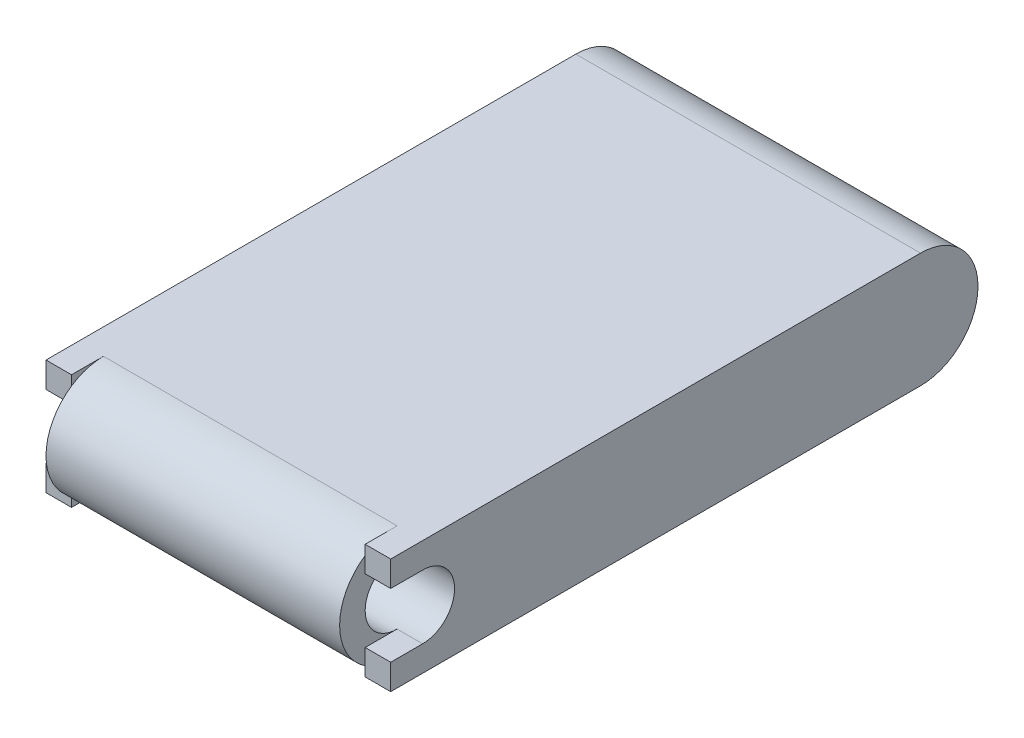
ISO-10303-21;
HEADER;
FILE_DESCRIPTION(('STEP AP214'),'2;1');
FILE_NAME('part.step','',(''),(''),'','','');
FILE_SCHEMA(('AUTOMOTIVE_DESIGN { 1 0 10303 214 1 1 1 1 }'));
ENDSEC;
DATA;
#1=APPLICATION_CONTEXT('core data for automotive mechanical design processes');
#2=APPLICATION_PROTOCOL_DEFINITION('international standard','automotive_design',2000,#1);
#3=PRODUCT_CONTEXT('',#1,'mechanical');
#4=PRODUCT('Part','Part','',(#3));
#5=PRODUCT_RELATED_PRODUCT_CATEGORY('part','',(#4));
#6=PRODUCT_DEFINITION_FORMATION('','',#4);
#7=PRODUCT_DEFINITION_CONTEXT('part definition',#1,'design');
#8=PRODUCT_DEFINITION('design','',#6,#7);
#9=PRODUCT_DEFINITION_SHAPE('','',#8);
#10=(LENGTH_UNIT() NAMED_UNIT(*) SI_UNIT(.MILLI.,.METRE.));
#11=(NAMED_UNIT(*) PLANE_ANGLE_UNIT() SI_UNIT($,.RADIAN.));
#12=(NAMED_UNIT(*) SI_UNIT($,.STERADIAN.) SOLID_ANGLE_UNIT());
#13=UNCERTAINTY_MEASURE_WITH_UNIT(LENGTH_MEASURE(1.E-05),#10,'distance_accuracy_value','');
#14=(GEOMETRIC_REPRESENTATION_CONTEXT(3) GLOBAL_UNCERTAINTY_ASSIGNED_CONTEXT((#13)) GLOBAL_UNIT_ASSIGNED_CONTEXT((#10,
#11,#12)) REPRESENTATION_CONTEXT('',''));
#15=CARTESIAN_POINT('',(0.,0.,0.));
#16=DIRECTION('',(0.,0.,1.));
#17=DIRECTION('',(1.,0.,0.));
#18=AXIS2_PLACEMENT_3D('',#15,#16,#17);
#19=CARTESIAN_POINT('',(-9.27481,0.,15.72768));
#20=DIRECTION('',(-1.,0.,0.));
#21=DIRECTION('',(0.,0.,-1.));
#22=AXIS2_PLACEMENT_3D('',#19,#20,#21);
#23=PLANE('',#22);
#24=CARTESIAN_POINT('',(-9.27481,0.,15.72768));
#25=DIRECTION('',(-1.,0.,0.));
#26=DIRECTION('',(0.,0.,1.));
#27=AXIS2_PLACEMENT_3D('',#24,#25,#26);
#28=CIRCLE('',#27,2.01676);
#29=CARTESIAN_POINT('',(-9.27481,2.01676,15.72768));
#30=VERTEX_POINT('',#29);
#31=CARTESIAN_POINT('',(-9.27481,-2.01676,15.72768));
#32=VERTEX_POINT('',#31);
#33=EDGE_CURVE('E269',#30,#32,#28,.F.);
#34=ORIENTED_EDGE('',*,*,#33,.T.);
#35=DIRECTION('',(0.,0.,1.));
#36=VECTOR('',#35,1.);
#37=CARTESIAN_POINT('',(-9.27481,-2.01676,15.72768));
#38=LINE('',#37,#36);
#39=CARTESIAN_POINT('',(-9.27481,-2.01676,17.74444));
#40=VERTEX_POINT('',#39);
#41=EDGE_CURVE('E49',#32,#40,#38,.T.);
#42=ORIENTED_EDGE('',*,*,#41,.T.);
#43=DIRECTION('',(0.,-1.,0.));
#44=VECTOR('',#43,1.);
#45=CARTESIAN_POINT('',(-9.27481,-2.01676,17.74444));
#46=LINE('',#45,#44);
#47=CARTESIAN_POINT('',(-9.27481,-3.01779900225313,17.74444));
#48=VERTEX_POINT('',#47);
#49=EDGE_CURVE('E186',#40,#48,#46,.T.);
#50=ORIENTED_EDGE('',*,*,#49,.T.);
#51=CARTESIAN_POINT('',(-9.27481,0.,15.72768));
#52=DIRECTION('',(1.,0.,0.));
#53=DIRECTION('',(0.,0.,-1.));
#54=AXIS2_PLACEMENT_3D('',#51,#52,#53);
#55=CIRCLE('',#54,3.62966);
#56=CARTESIAN_POINT('',(-9.27481,3.01779900225313,17.74444));
#57=VERTEX_POINT('',#56);
#58=EDGE_CURVE('E267',#57,#48,#55,.T.);
#59=ORIENTED_EDGE('',*,*,#58,.F.);
#60=DIRECTION('',(0.,-1.,0.));
#61=VECTOR('',#60,1.);
#62=CARTESIAN_POINT('',(-9.27481,3.62966,17.74444));
#63=LINE('',#62,#61);
#64=CARTESIAN_POINT('',(-9.27481,2.01676,17.74444));
#65=VERTEX_POINT('',#64);
#66=EDGE_CURVE('E56',#57,#65,#63,.T.);
#67=ORIENTED_EDGE('',*,*,#66,.T.);
#68=DIRECTION('',(0.,0.,-1.));
#69=VECTOR('',#68,1.);
#70=CARTESIAN_POINT('',(-9.27481,2.01676,15.72768));
#71=LINE('',#70,#69);
#72=EDGE_CURVE('E180',#65,#30,#71,.T.);
#73=ORIENTED_EDGE('',*,*,#72,.T.);
#74=EDGE_LOOP('',(#34,#42,#50,#59,#67,#73));
#75=FACE_BOUND('',#74,.T.);
#76=ADVANCED_FACE('F32',(#75),#23,.T.);
#77=CARTESIAN_POINT('',(-10.88771,0.,15.72768));
#78=DIRECTION('',(1.,0.,0.));
#79=DIRECTION('',(0.,0.,-1.));
#80=AXIS2_PLACEMENT_3D('',#77,#78,#79);
#81=CYLINDRICAL_SURFACE('',#80,3.62966);
#82=DIRECTION('',(1.,0.,0.));
#83=VECTOR('',#82,1.);
#84=CARTESIAN_POINT('',(-10.88771,3.62966,15.72768));
#85=LINE('',#84,#83);
#86=CARTESIAN_POINT('',(-9.27481,3.62966,15.72768));
#87=VERTEX_POINT('',#86);
#88=CARTESIAN_POINT('',(9.27481,3.62966,15.72768));
#89=VERTEX_POINT('',#88);
#90=EDGE_CURVE('E11',#87,#89,#85,.T.);
#91=ORIENTED_EDGE('',*,*,#90,.F.);
#92=EDGE_CURVE('E164',#87,#57,#55,.T.);
#93=ORIENTED_EDGE('',*,*,#92,.T.);
#94=ORIENTED_EDGE('',*,*,#58,.T.);
#95=CARTESIAN_POINT('',(-9.27481,0.,15.72768));
#96=DIRECTION('',(-1.,0.,0.));
#97=DIRECTION('',(0.,0.,1.));
#98=AXIS2_PLACEMENT_3D('',#95,#96,#97);
#99=CIRCLE('',#98,3.62966);
#100=CARTESIAN_POINT('',(-9.27481,-3.62966,15.72768));
#101=VERTEX_POINT('',#100);
#102=EDGE_CURVE('E205',#48,#101,#99,.F.);
#103=ORIENTED_EDGE('',*,*,#102,.T.);
#104=DIRECTION('',(1.,0.,0.));
#105=VECTOR('',#104,1.);
#106=CARTESIAN_POINT('',(-10.88771,-3.62966,15.72768));
#107=LINE('',#106,#105);
#108=CARTESIAN_POINT('',(9.27481,-3.62966,15.72768));
#109=VERTEX_POINT('',#108);
#110=EDGE_CURVE('E289',#101,#109,#107,.T.);
#111=ORIENTED_EDGE('',*,*,#110,.T.);
#112=CARTESIAN_POINT('',(9.27481,0.,15.72768));
#113=DIRECTION('',(1.,0.,0.));
#114=DIRECTION('',(0.,0.,-1.));
#115=AXIS2_PLACEMENT_3D('',#112,#113,#114);
#116=CIRCLE('',#115,3.62966);
#117=CARTESIAN_POINT('',(9.27481,-3.01779900225313,17.74444));
#118=VERTEX_POINT('',#117);
#119=EDGE_CURVE('E254',#109,#118,#116,.F.);
#120=ORIENTED_EDGE('',*,*,#119,.T.);
#121=CARTESIAN_POINT('',(9.27481,0.,15.72768));
#122=DIRECTION('',(1.,0.,0.));
#123=DIRECTION('',(0.,0.,-1.));
#124=AXIS2_PLACEMENT_3D('',#121,#122,#123);
#125=CIRCLE('',#124,3.62966);
#126=CARTESIAN_POINT('',(9.27481,3.01779900225313,17.74444));
#127=VERTEX_POINT('',#126);
#128=EDGE_CURVE('E271',#127,#118,#125,.T.);
#129=ORIENTED_EDGE('',*,*,#128,.F.);
#130=EDGE_CURVE('E272',#89,#127,#125,.T.);
#131=ORIENTED_EDGE('',*,*,#130,.F.);
#132=EDGE_LOOP('',(#91,#93,#94,#103,#111,#120,#129,#131));
#133=FACE_BOUND('',#132,.T.);
#134=ADVANCED_FACE('F34',(#133),#81,.T.);
#135=CARTESIAN_POINT('',(-10.88771,0.,15.72768));
#136=DIRECTION('',(1.,0.,0.));
#137=DIRECTION('',(0.,0.,-1.));
#138=AXIS2_PLACEMENT_3D('',#135,#136,#137);
#139=CYLINDRICAL_SURFACE('',#138,2.01676);
#140=CARTESIAN_POINT('',(9.27481,0.,15.72768));
#141=DIRECTION('',(1.,0.,0.));
#142=DIRECTION('',(0.,0.,-1.));
#143=AXIS2_PLACEMENT_3D('',#140,#141,#142);
#144=CIRCLE('',#143,2.01676);
#145=CARTESIAN_POINT('',(9.27481,-2.01676,15.72768));
#146=VERTEX_POINT('',#145);
#147=CARTESIAN_POINT('',(9.27481,2.01676,15.72768));
#148=VERTEX_POINT('',#147);
#149=EDGE_CURVE('E36',#146,#148,#144,.F.);
#150=ORIENTED_EDGE('',*,*,#149,.F.);
#151=DIRECTION('',(1.,0.,0.));
#152=VECTOR('',#151,1.);
#153=CARTESIAN_POINT('',(9.27481,-2.01676,15.72768));
#154=LINE('',#153,#152);
#155=CARTESIAN_POINT('',(10.88771,-2.01676,15.72768));
#156=VERTEX_POINT('',#155);
#157=EDGE_CURVE('E238',#146,#156,#154,.T.);
#158=ORIENTED_EDGE('',*,*,#157,.T.);
#159=CARTESIAN_POINT('',(10.88771,0.,15.72768));
#160=DIRECTION('',(-1.,0.,0.));
#161=DIRECTION('',(0.,0.,-1.));
#162=AXIS2_PLACEMENT_3D('',#159,#160,#161);
#163=CIRCLE('',#162,2.01676);
#164=CARTESIAN_POINT('',(10.88771,2.01676,15.72768));
#165=VERTEX_POINT('',#164);
#166=EDGE_CURVE('E216',#165,#156,#163,.T.);
#167=ORIENTED_EDGE('',*,*,#166,.F.);
#168=DIRECTION('',(1.,0.,0.));
#169=VECTOR('',#168,1.);
#170=CARTESIAN_POINT('',(9.27481,2.01676,15.72768));
#171=LINE('',#170,#169);
#172=EDGE_CURVE('E252',#148,#165,#171,.T.);
#173=ORIENTED_EDGE('',*,*,#172,.F.);
#174=EDGE_LOOP('',(#150,#158,#167,#173));
#175=FACE_BOUND('',#174,.T.);
#176=ORIENTED_EDGE('',*,*,#33,.F.);
#177=DIRECTION('',(-1.,0.,0.));
#178=VECTOR('',#177,1.);
#179=CARTESIAN_POINT('',(-9.27481,2.01676,15.72768));
#180=LINE('',#179,#178);
#181=CARTESIAN_POINT('',(-10.88771,2.01676,15.72768));
#182=VERTEX_POINT('',#181);
#183=EDGE_CURVE('E189',#30,#182,#180,.T.);
#184=ORIENTED_EDGE('',*,*,#183,.T.);
#185=CARTESIAN_POINT('',(-10.88771,0.,15.72768));
#186=DIRECTION('',(-1.,0.,0.));
#187=DIRECTION('',(0.,0.,-1.));
#188=AXIS2_PLACEMENT_3D('',#185,#186,#187);
#189=CIRCLE('',#188,2.01676);
#190=CARTESIAN_POINT('',(-10.88771,-2.01676,15.72768));
#191=VERTEX_POINT('',#190);
#192=EDGE_CURVE('E190',#182,#191,#189,.T.);
#193=ORIENTED_EDGE('',*,*,#192,.T.);
#194=DIRECTION('',(-1.,0.,0.));
#195=VECTOR('',#194,1.);
#196=CARTESIAN_POINT('',(-9.27481,-2.01676,15.72768));
#197=LINE('',#196,#195);
#198=EDGE_CURVE('E202',#32,#191,#197,.T.);
#199=ORIENTED_EDGE('',*,*,#198,.F.);
#200=EDGE_LOOP('',(#176,#184,#193,#199));
#201=FACE_BOUND('',#200,.T.);
#202=ADVANCED_FACE('F352',(#175,#201),#139,.F.);
#203=CARTESIAN_POINT('',(-10.88771,0.,15.72768));
#204=DIRECTION('',(1.,0.,0.));
#205=DIRECTION('',(0.,0.,-1.));
#206=AXIS2_PLACEMENT_3D('',#203,#204,#205);
#207=PLANE('',#206);
#208=DIRECTION('',(0.,0.,-1.));
#209=VECTOR('',#208,1.);
#210=CARTESIAN_POINT('',(-10.88771,-3.62966,15.72768));
#211=LINE('',#210,#209);
#212=CARTESIAN_POINT('',(-10.88771,-3.62966,17.74444));
#213=VERTEX_POINT('',#212);
#214=CARTESIAN_POINT('',(-10.88771,-3.62966,-15.72768));
#215=VERTEX_POINT('',#214);
#216=EDGE_CURVE('E283',#213,#215,#211,.T.);
#217=ORIENTED_EDGE('',*,*,#216,.F.);
#218=DIRECTION('',(0.,-1.,0.));
#219=VECTOR('',#218,1.);
#220=CARTESIAN_POINT('',(-10.88771,-2.01676,17.74444));
#221=LINE('',#220,#219);
#222=CARTESIAN_POINT('',(-10.88771,-2.01676,17.74444));
#223=VERTEX_POINT('',#222);
#224=EDGE_CURVE('E197',#223,#213,#221,.T.);
#225=ORIENTED_EDGE('',*,*,#224,.F.);
#226=DIRECTION('',(0.,0.,1.));
#227=VECTOR('',#226,1.);
#228=CARTESIAN_POINT('',(-10.88771,-2.01676,15.72768));
#229=LINE('',#228,#227);
#230=EDGE_CURVE('E200',#191,#223,#229,.T.);
#231=ORIENTED_EDGE('',*,*,#230,.F.);
#232=ORIENTED_EDGE('',*,*,#192,.F.);
#233=DIRECTION('',(0.,0.,-1.));
#234=VECTOR('',#233,1.);
#235=CARTESIAN_POINT('',(-10.88771,2.01676,15.72768));
#236=LINE('',#235,#234);
#237=CARTESIAN_POINT('',(-10.88771,2.01676,17.74444));
#238=VERTEX_POINT('',#237);
#239=EDGE_CURVE('E193',#238,#182,#236,.T.);
#240=ORIENTED_EDGE('',*,*,#239,.F.);
#241=DIRECTION('',(0.,-1.,0.));
#242=VECTOR('',#241,1.);
#243=CARTESIAN_POINT('',(-10.88771,3.62966,17.74444));
#244=LINE('',#243,#242);
#245=CARTESIAN_POINT('',(-10.88771,3.62966,17.74444));
#246=VERTEX_POINT('',#245);
#247=EDGE_CURVE('E195',#246,#238,#244,.T.);
#248=ORIENTED_EDGE('',*,*,#247,.F.);
#249=DIRECTION('',(0.,0.,1.));
#250=VECTOR('',#249,1.);
#251=CARTESIAN_POINT('',(-10.88771,3.62966,15.72768));
#252=LINE('',#251,#250);
#253=CARTESIAN_POINT('',(-10.88771,3.62966,-15.72768));
#254=VERTEX_POINT('',#253);
#255=EDGE_CURVE('E172',#254,#246,#252,.T.);
#256=ORIENTED_EDGE('',*,*,#255,.F.);
#257=CARTESIAN_POINT('',(-10.88771,0.,-15.72768));
#258=DIRECTION('',(1.,0.,0.));
#259=DIRECTION('',(0.,0.,-1.));
#260=AXIS2_PLACEMENT_3D('',#257,#258,#259);
#261=CIRCLE('',#260,3.62966);
#262=EDGE_CURVE('E286',#215,#254,#261,.T.);
#263=ORIENTED_EDGE('',*,*,#262,.F.);
#264=EDGE_LOOP('',(#217,#225,#231,#232,#240,#248,#256,#263));
#265=FACE_BOUND('',#264,.T.);
#266=ADVANCED_FACE('F344',(#265),#207,.F.);
#267=CARTESIAN_POINT('',(-10.88771,3.62966,15.72768));
#268=DIRECTION('',(0.,1.,0.));
#269=DIRECTION('',(0.,0.,1.));
#270=AXIS2_PLACEMENT_3D('',#267,#268,#269);
#271=PLANE('',#270);
#272=ORIENTED_EDGE('',*,*,#255,.T.);
#273=DIRECTION('',(-1.,0.,0.));
#274=VECTOR('',#273,1.);
#275=CARTESIAN_POINT('',(-9.27481,3.62966,17.74444));
#276=LINE('',#275,#274);
#277=CARTESIAN_POINT('',(-9.27481,3.62966,17.74444));
#278=VERTEX_POINT('',#277);
#279=EDGE_CURVE('E169',#278,#246,#276,.T.);
#280=ORIENTED_EDGE('',*,*,#279,.F.);
#281=DIRECTION('',(0.,0.,1.));
#282=VECTOR('',#281,1.);
#283=CARTESIAN_POINT('',(-9.27481,3.62966,15.72768));
#284=LINE('',#283,#282);
#285=EDGE_CURVE('E158',#87,#278,#284,.T.);
#286=ORIENTED_EDGE('',*,*,#285,.F.);
#287=ORIENTED_EDGE('',*,*,#90,.T.);
#288=DIRECTION('',(0.,0.,1.));
#289=VECTOR('',#288,1.);
#290=CARTESIAN_POINT('',(9.27481,3.62966,15.72768));
#291=LINE('',#290,#289);
#292=CARTESIAN_POINT('',(9.27481,3.62966,17.74444));
#293=VERTEX_POINT('',#292);
#294=EDGE_CURVE('E228',#89,#293,#291,.T.);
#295=ORIENTED_EDGE('',*,*,#294,.T.);
#296=DIRECTION('',(1.,0.,0.));
#297=VECTOR('',#296,1.);
#298=CARTESIAN_POINT('',(9.27481,3.62966,17.74444));
#299=LINE('',#298,#297);
#300=CARTESIAN_POINT('',(10.88771,3.62966,17.74444));
#301=VERTEX_POINT('',#300);
#302=EDGE_CURVE('E257',#293,#301,#299,.T.);
#303=ORIENTED_EDGE('',*,*,#302,.T.);
#304=DIRECTION('',(0.,0.,1.));
#305=VECTOR('',#304,1.);
#306=CARTESIAN_POINT('',(10.88771,3.62966,15.72768));
#307=LINE('',#306,#305);
#308=CARTESIAN_POINT('',(10.88771,3.62966,-15.72768));
#309=VERTEX_POINT('',#308);
#310=EDGE_CURVE('E281',#309,#301,#307,.T.);
#311=ORIENTED_EDGE('',*,*,#310,.F.);
#312=DIRECTION('',(1.,0.,0.));
#313=VECTOR('',#312,1.);
#314=CARTESIAN_POINT('',(-10.88771,3.62966,-15.72768));
#315=LINE('',#314,#313);
#316=EDGE_CURVE('E41',#254,#309,#315,.T.);
#317=ORIENTED_EDGE('',*,*,#316,.F.);
#318=EDGE_LOOP('',(#272,#280,#286,#287,#295,#303,#311,#317));
#319=FACE_BOUND('',#318,.T.);
#320=ADVANCED_FACE('F170',(#319),#271,.T.);
#321=CARTESIAN_POINT('',(-10.88771,0.,-15.72768));
#322=DIRECTION('',(1.,0.,0.));
#323=DIRECTION('',(0.,0.,-1.));
#324=AXIS2_PLACEMENT_3D('',#321,#322,#323);
#325=CYLINDRICAL_SURFACE('',#324,3.62966);
#326=ORIENTED_EDGE('',*,*,#316,.T.);
#327=CARTESIAN_POINT('',(10.88771,0.,-15.72768));
#328=DIRECTION('',(1.,0.,0.));
#329=DIRECTION('',(0.,0.,-1.));
#330=AXIS2_PLACEMENT_3D('',#327,#328,#329);
#331=CIRCLE('',#330,3.62966);
#332=CARTESIAN_POINT('',(10.88771,-3.62966,-15.72768));
#333=VERTEX_POINT('',#332);
#334=EDGE_CURVE('E278',#333,#309,#331,.T.);
#335=ORIENTED_EDGE('',*,*,#334,.F.);
#336=DIRECTION('',(1.,0.,0.));
#337=VECTOR('',#336,1.);
#338=CARTESIAN_POINT('',(-10.88771,-3.62966,-15.72768));
#339=LINE('',#338,#337);
#340=EDGE_CURVE('E292',#215,#333,#339,.T.);
#341=ORIENTED_EDGE('',*,*,#340,.F.);
#342=ORIENTED_EDGE('',*,*,#262,.T.);
#343=EDGE_LOOP('',(#326,#335,#341,#342));
#344=FACE_BOUND('',#343,.T.);
#345=ADVANCED_FACE('F346',(#344),#325,.T.);
#346=CARTESIAN_POINT('',(-10.88771,-3.62966,15.72768));
#347=DIRECTION('',(0.,-1.,0.));
#348=DIRECTION('',(0.,0.,-1.));
#349=AXIS2_PLACEMENT_3D('',#346,#347,#348);
#350=PLANE('',#349);
#351=ORIENTED_EDGE('',*,*,#340,.T.);
#352=DIRECTION('',(0.,0.,-1.));
#353=VECTOR('',#352,1.);
#354=CARTESIAN_POINT('',(10.88771,-3.62966,15.72768));
#355=LINE('',#354,#353);
#356=CARTESIAN_POINT('',(10.88771,-3.62966,17.74444));
#357=VERTEX_POINT('',#356);
#358=EDGE_CURVE('E275',#357,#333,#355,.T.);
#359=ORIENTED_EDGE('',*,*,#358,.F.);
#360=DIRECTION('',(1.,0.,0.));
#361=VECTOR('',#360,1.);
#362=CARTESIAN_POINT('',(9.27481,-3.62966,17.74444));
#363=LINE('',#362,#361);
#364=CARTESIAN_POINT('',(9.27481,-3.62966,17.74444));
#365=VERTEX_POINT('',#364);
#366=EDGE_CURVE('E260',#365,#357,#363,.T.);
#367=ORIENTED_EDGE('',*,*,#366,.F.);
#368=DIRECTION('',(0.,0.,-1.));
#369=VECTOR('',#368,1.);
#370=CARTESIAN_POINT('',(9.27481,-3.62966,15.72768));
#371=LINE('',#370,#369);
#372=EDGE_CURVE('E225',#365,#109,#371,.T.);
#373=ORIENTED_EDGE('',*,*,#372,.T.);
#374=ORIENTED_EDGE('',*,*,#110,.F.);
#375=DIRECTION('',(0.,0.,-1.));
#376=VECTOR('',#375,1.);
#377=CARTESIAN_POINT('',(-9.27481,-3.62966,15.72768));
#378=LINE('',#377,#376);
#379=CARTESIAN_POINT('',(-9.27481,-3.62966,17.74444));
#380=VERTEX_POINT('',#379);
#381=EDGE_CURVE('E166',#380,#101,#378,.T.);
#382=ORIENTED_EDGE('',*,*,#381,.F.);
#383=DIRECTION('',(-1.,0.,0.));
#384=VECTOR('',#383,1.);
#385=CARTESIAN_POINT('',(-9.27481,-3.62966,17.74444));
#386=LINE('',#385,#384);
#387=EDGE_CURVE('E175',#380,#213,#386,.T.);
#388=ORIENTED_EDGE('',*,*,#387,.T.);
#389=ORIENTED_EDGE('',*,*,#216,.T.);
#390=EDGE_LOOP('',(#351,#359,#367,#373,#374,#382,#388,#389));
#391=FACE_BOUND('',#390,.T.);
#392=ADVANCED_FACE('F307',(#391),#350,.T.);
#393=CARTESIAN_POINT('',(10.88771,0.,15.72768));
#394=DIRECTION('',(1.,0.,0.));
#395=DIRECTION('',(0.,0.,-1.));
#396=AXIS2_PLACEMENT_3D('',#393,#394,#395);
#397=PLANE('',#396);
#398=ORIENTED_EDGE('',*,*,#310,.T.);
#399=DIRECTION('',(0.,-1.,0.));
#400=VECTOR('',#399,1.);
#401=CARTESIAN_POINT('',(10.88771,3.62966,17.74444));
#402=LINE('',#401,#400);
#403=CARTESIAN_POINT('',(10.88771,2.01676,17.74444));
#404=VERTEX_POINT('',#403);
#405=EDGE_CURVE('E247',#301,#404,#402,.T.);
#406=ORIENTED_EDGE('',*,*,#405,.T.);
#407=DIRECTION('',(0.,0.,-1.));
#408=VECTOR('',#407,1.);
#409=CARTESIAN_POINT('',(10.88771,2.01676,15.72768));
#410=LINE('',#409,#408);
#411=EDGE_CURVE('E221',#404,#165,#410,.T.);
#412=ORIENTED_EDGE('',*,*,#411,.T.);
#413=ORIENTED_EDGE('',*,*,#166,.T.);
#414=DIRECTION('',(0.,0.,1.));
#415=VECTOR('',#414,1.);
#416=CARTESIAN_POINT('',(10.88771,-2.01676,15.72768));
#417=LINE('',#416,#415);
#418=CARTESIAN_POINT('',(10.88771,-2.01676,17.74444));
#419=VERTEX_POINT('',#418);
#420=EDGE_CURVE('E241',#156,#419,#417,.T.);
#421=ORIENTED_EDGE('',*,*,#420,.T.);
#422=DIRECTION('',(0.,-1.,0.));
#423=VECTOR('',#422,1.);
#424=CARTESIAN_POINT('',(10.88771,-2.01676,17.74444));
#425=LINE('',#424,#423);
#426=EDGE_CURVE('E244',#419,#357,#425,.T.);
#427=ORIENTED_EDGE('',*,*,#426,.T.);
#428=ORIENTED_EDGE('',*,*,#358,.T.);
#429=ORIENTED_EDGE('',*,*,#334,.T.);
#430=EDGE_LOOP('',(#398,#406,#412,#413,#421,#427,#428,#429));
#431=FACE_BOUND('',#430,.T.);
#432=ADVANCED_FACE('F313',(#431),#397,.T.);
#433=CARTESIAN_POINT('',(9.27481,0.,15.72768));
#434=DIRECTION('',(1.,0.,0.));
#435=DIRECTION('',(0.,0.,-1.));
#436=AXIS2_PLACEMENT_3D('',#433,#434,#435);
#437=PLANE('',#436);
#438=DIRECTION('',(0.,0.,-1.));
#439=VECTOR('',#438,1.);
#440=CARTESIAN_POINT('',(9.27481,2.01676,15.72768));
#441=LINE('',#440,#439);
#442=CARTESIAN_POINT('',(9.27481,2.01676,17.74444));
#443=VERTEX_POINT('',#442);
#444=EDGE_CURVE('E235',#443,#148,#441,.T.);
#445=ORIENTED_EDGE('',*,*,#444,.F.);
#446=DIRECTION('',(0.,-1.,0.));
#447=VECTOR('',#446,1.);
#448=CARTESIAN_POINT('',(9.27481,3.62966,17.74444));
#449=LINE('',#448,#447);
#450=EDGE_CURVE('E231',#127,#443,#449,.T.);
#451=ORIENTED_EDGE('',*,*,#450,.F.);
#452=ORIENTED_EDGE('',*,*,#128,.T.);
#453=DIRECTION('',(0.,-1.,0.));
#454=VECTOR('',#453,1.);
#455=CARTESIAN_POINT('',(9.27481,-2.01676,17.74444));
#456=LINE('',#455,#454);
#457=CARTESIAN_POINT('',(9.27481,-2.01676,17.74444));
#458=VERTEX_POINT('',#457);
#459=EDGE_CURVE('E222',#458,#118,#456,.T.);
#460=ORIENTED_EDGE('',*,*,#459,.F.);
#461=DIRECTION('',(0.,0.,1.));
#462=VECTOR('',#461,1.);
#463=CARTESIAN_POINT('',(9.27481,-2.01676,15.72768));
#464=LINE('',#463,#462);
#465=EDGE_CURVE('E217',#146,#458,#464,.T.);
#466=ORIENTED_EDGE('',*,*,#465,.F.);
#467=ORIENTED_EDGE('',*,*,#149,.T.);
#468=EDGE_LOOP('',(#445,#451,#452,#460,#466,#467));
#469=FACE_BOUND('',#468,.T.);
#470=ADVANCED_FACE('F321',(#469),#437,.T.);
#471=CARTESIAN_POINT('',(9.27481,0.,15.72768));
#472=DIRECTION('',(1.,0.,0.));
#473=DIRECTION('',(0.,0.,-1.));
#474=AXIS2_PLACEMENT_3D('',#471,#472,#473);
#475=PLANE('',#474);
#476=ORIENTED_EDGE('',*,*,#119,.F.);
#477=ORIENTED_EDGE('',*,*,#372,.F.);
#478=EDGE_CURVE('E220',#118,#365,#456,.T.);
#479=ORIENTED_EDGE('',*,*,#478,.F.);
#480=EDGE_LOOP('',(#476,#477,#479));
#481=FACE_BOUND('',#480,.T.);
#482=ADVANCED_FACE('F305',(#481),#475,.F.);
#483=CARTESIAN_POINT('',(9.27481,2.01676,15.72768));
#484=DIRECTION('',(0.,-1.,0.));
#485=DIRECTION('',(0.,0.,-1.));
#486=AXIS2_PLACEMENT_3D('',#483,#484,#485);
#487=PLANE('',#486);
#488=ORIENTED_EDGE('',*,*,#411,.F.);
#489=DIRECTION('',(1.,0.,0.));
#490=VECTOR('',#489,1.);
#491=CARTESIAN_POINT('',(9.27481,2.01676,17.74444));
#492=LINE('',#491,#490);
#493=EDGE_CURVE('E255',#443,#404,#492,.T.);
#494=ORIENTED_EDGE('',*,*,#493,.F.);
#495=ORIENTED_EDGE('',*,*,#444,.T.);
#496=ORIENTED_EDGE('',*,*,#172,.T.);
#497=EDGE_LOOP('',(#488,#494,#495,#496));
#498=FACE_BOUND('',#497,.T.);
#499=ADVANCED_FACE('F349',(#498),#487,.T.);
#500=CARTESIAN_POINT('',(9.27481,3.62966,17.74444));
#501=DIRECTION('',(0.,0.,1.));
#502=DIRECTION('',(1.,0.,0.));
#503=AXIS2_PLACEMENT_3D('',#500,#501,#502);
#504=PLANE('',#503);
#505=ORIENTED_EDGE('',*,*,#405,.F.);
#506=ORIENTED_EDGE('',*,*,#302,.F.);
#507=EDGE_CURVE('E232',#293,#127,#449,.T.);
#508=ORIENTED_EDGE('',*,*,#507,.T.);
#509=ORIENTED_EDGE('',*,*,#450,.T.);
#510=ORIENTED_EDGE('',*,*,#493,.T.);
#511=EDGE_LOOP('',(#505,#506,#508,#509,#510));
#512=FACE_BOUND('',#511,.T.);
#513=ADVANCED_FACE('F331',(#512),#504,.T.);
#514=CARTESIAN_POINT('',(9.27481,-2.01676,17.74444));
#515=DIRECTION('',(0.,0.,1.));
#516=DIRECTION('',(1.,0.,0.));
#517=AXIS2_PLACEMENT_3D('',#514,#515,#516);
#518=PLANE('',#517);
#519=ORIENTED_EDGE('',*,*,#426,.F.);
#520=DIRECTION('',(1.,0.,0.));
#521=VECTOR('',#520,1.);
#522=CARTESIAN_POINT('',(9.27481,-2.01676,17.74444));
#523=LINE('',#522,#521);
#524=EDGE_CURVE('E263',#458,#419,#523,.T.);
#525=ORIENTED_EDGE('',*,*,#524,.F.);
#526=ORIENTED_EDGE('',*,*,#459,.T.);
#527=ORIENTED_EDGE('',*,*,#478,.T.);
#528=ORIENTED_EDGE('',*,*,#366,.T.);
#529=EDGE_LOOP('',(#519,#525,#526,#527,#528));
#530=FACE_BOUND('',#529,.T.);
#531=ADVANCED_FACE('F310',(#530),#518,.T.);
#532=CARTESIAN_POINT('',(9.27481,-2.01676,15.72768));
#533=DIRECTION('',(0.,1.,0.));
#534=DIRECTION('',(0.,0.,1.));
#535=AXIS2_PLACEMENT_3D('',#532,#533,#534);
#536=PLANE('',#535);
#537=ORIENTED_EDGE('',*,*,#420,.F.);
#538=ORIENTED_EDGE('',*,*,#157,.F.);
#539=ORIENTED_EDGE('',*,*,#465,.T.);
#540=ORIENTED_EDGE('',*,*,#524,.T.);
#541=EDGE_LOOP('',(#537,#538,#539,#540));
#542=FACE_BOUND('',#541,.T.);
#543=ADVANCED_FACE('F319',(#542),#536,.T.);
#544=ORIENTED_EDGE('',*,*,#130,.T.);
#545=ORIENTED_EDGE('',*,*,#507,.F.);
#546=ORIENTED_EDGE('',*,*,#294,.F.);
#547=EDGE_LOOP('',(#544,#545,#546));
#548=FACE_BOUND('',#547,.T.);
#549=ADVANCED_FACE('F328',(#548),#475,.F.);
#550=CARTESIAN_POINT('',(-9.27481,0.,15.72768));
#551=DIRECTION('',(-1.,0.,0.));
#552=DIRECTION('',(0.,0.,-1.));
#553=AXIS2_PLACEMENT_3D('',#550,#551,#552);
#554=PLANE('',#553);
#555=ORIENTED_EDGE('',*,*,#102,.F.);
#556=EDGE_CURVE('E185',#48,#380,#46,.T.);
#557=ORIENTED_EDGE('',*,*,#556,.T.);
#558=ORIENTED_EDGE('',*,*,#381,.T.);
#559=EDGE_LOOP('',(#555,#557,#558));
#560=FACE_BOUND('',#559,.T.);
#561=ADVANCED_FACE('F336',(#560),#554,.F.);
#562=CARTESIAN_POINT('',(-9.27481,-2.01676,15.72768));
#563=DIRECTION('',(0.,-1.,0.));
#564=DIRECTION('',(0.,0.,-1.));
#565=AXIS2_PLACEMENT_3D('',#562,#563,#564);
#566=PLANE('',#565);
#567=ORIENTED_EDGE('',*,*,#230,.T.);
#568=DIRECTION('',(-1.,0.,0.));
#569=VECTOR('',#568,1.);
#570=CARTESIAN_POINT('',(-9.27481,-2.01676,17.74444));
#571=LINE('',#570,#569);
#572=EDGE_CURVE('E206',#40,#223,#571,.T.);
#573=ORIENTED_EDGE('',*,*,#572,.F.);
#574=ORIENTED_EDGE('',*,*,#41,.F.);
#575=ORIENTED_EDGE('',*,*,#198,.T.);
#576=EDGE_LOOP('',(#567,#573,#574,#575));
#577=FACE_BOUND('',#576,.T.);
#578=ADVANCED_FACE('F365',(#577),#566,.F.);
#579=CARTESIAN_POINT('',(-9.27481,-2.01676,17.74444));
#580=DIRECTION('',(0.,0.,-1.));
#581=DIRECTION('',(-1.,0.,0.));
#582=AXIS2_PLACEMENT_3D('',#579,#580,#581);
#583=PLANE('',#582);
#584=ORIENTED_EDGE('',*,*,#224,.T.);
#585=ORIENTED_EDGE('',*,*,#387,.F.);
#586=ORIENTED_EDGE('',*,*,#556,.F.);
#587=ORIENTED_EDGE('',*,*,#49,.F.);
#588=ORIENTED_EDGE('',*,*,#572,.T.);
#589=EDGE_LOOP('',(#584,#585,#586,#587,#588));
#590=FACE_BOUND('',#589,.T.);
#591=ADVANCED_FACE('F340',(#590),#583,.F.);
#592=CARTESIAN_POINT('',(-9.27481,3.62966,17.74444));
#593=DIRECTION('',(0.,0.,-1.));
#594=DIRECTION('',(-1.,0.,0.));
#595=AXIS2_PLACEMENT_3D('',#592,#593,#594);
#596=PLANE('',#595);
#597=ORIENTED_EDGE('',*,*,#247,.T.);
#598=DIRECTION('',(-1.,0.,0.));
#599=VECTOR('',#598,1.);
#600=CARTESIAN_POINT('',(-9.27481,2.01676,17.74444));
#601=LINE('',#600,#599);
#602=EDGE_CURVE('E176',#65,#238,#601,.T.);
#603=ORIENTED_EDGE('',*,*,#602,.F.);
#604=ORIENTED_EDGE('',*,*,#66,.F.);
#605=EDGE_CURVE('E162',#278,#57,#63,.T.);
#606=ORIENTED_EDGE('',*,*,#605,.F.);
#607=ORIENTED_EDGE('',*,*,#279,.T.);
#608=EDGE_LOOP('',(#597,#603,#604,#606,#607));
#609=FACE_BOUND('',#608,.T.);
#610=ADVANCED_FACE('F178',(#609),#596,.F.);
#611=CARTESIAN_POINT('',(-9.27481,2.01676,15.72768));
#612=DIRECTION('',(0.,1.,0.));
#613=DIRECTION('',(0.,0.,1.));
#614=AXIS2_PLACEMENT_3D('',#611,#612,#613);
#615=PLANE('',#614);
#616=ORIENTED_EDGE('',*,*,#239,.T.);
#617=ORIENTED_EDGE('',*,*,#183,.F.);
#618=ORIENTED_EDGE('',*,*,#72,.F.);
#619=ORIENTED_EDGE('',*,*,#602,.T.);
#620=EDGE_LOOP('',(#616,#617,#618,#619));
#621=FACE_BOUND('',#620,.T.);
#622=ADVANCED_FACE('F362',(#621),#615,.F.);
#623=ORIENTED_EDGE('',*,*,#92,.F.);
#624=ORIENTED_EDGE('',*,*,#285,.T.);
#625=ORIENTED_EDGE('',*,*,#605,.T.);
#626=EDGE_LOOP('',(#623,#624,#625));
#627=FACE_BOUND('',#626,.T.);
#628=ADVANCED_FACE('F160',(#627),#554,.F.);
#629=CLOSED_SHELL('',(#76,#134,#202,#266,#320,#345,#392,#432,#470,#482,#499,#513,#531,#543,#549,
#561,#578,#591,#610,#622,#628));
#630=MANIFOLD_SOLID_BREP('B2',#629);
#631=ADVANCED_BREP_SHAPE_REPRESENTATION('',(#18,#630),#14);
#632=SHAPE_DEFINITION_REPRESENTATION(#9,#631);
ENDSEC;
END-ISO-10303-21;
